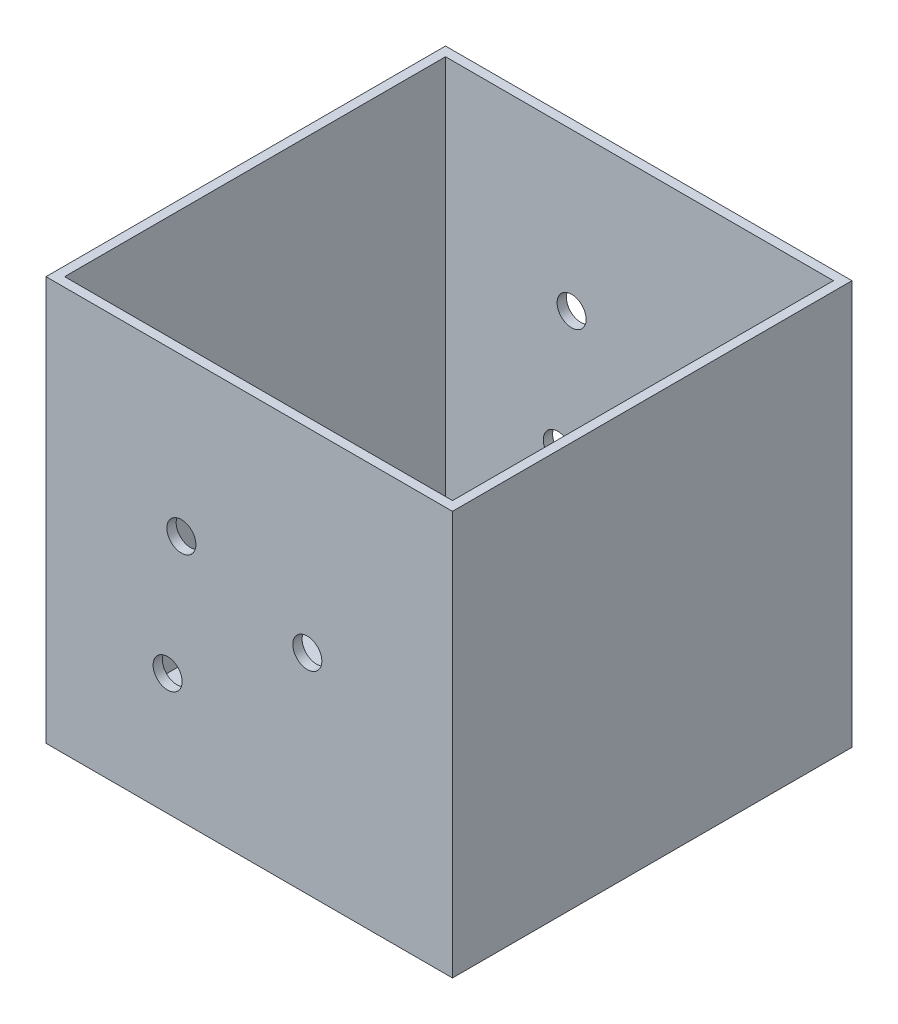
ISO-10303-21;
HEADER;
FILE_DESCRIPTION(('STEP AP214'),'2;1');
FILE_NAME('part.step','',(''),(''),'','','');
FILE_SCHEMA(('AUTOMOTIVE_DESIGN { 1 0 10303 214 1 1 1 1 }'));
ENDSEC;
DATA;
#1=APPLICATION_CONTEXT('core data for automotive mechanical design processes');
#2=APPLICATION_PROTOCOL_DEFINITION('international standard','automotive_design',2000,#1);
#3=PRODUCT_CONTEXT('',#1,'mechanical');
#4=PRODUCT('Part','Part','',(#3));
#5=PRODUCT_RELATED_PRODUCT_CATEGORY('part','',(#4));
#6=PRODUCT_DEFINITION_FORMATION('','',#4);
#7=PRODUCT_DEFINITION_CONTEXT('part definition',#1,'design');
#8=PRODUCT_DEFINITION('design','',#6,#7);
#9=PRODUCT_DEFINITION_SHAPE('','',#8);
#10=(LENGTH_UNIT() NAMED_UNIT(*) SI_UNIT(.MILLI.,.METRE.));
#11=(NAMED_UNIT(*) PLANE_ANGLE_UNIT() SI_UNIT($,.RADIAN.));
#12=(NAMED_UNIT(*) SI_UNIT($,.STERADIAN.) SOLID_ANGLE_UNIT());
#13=UNCERTAINTY_MEASURE_WITH_UNIT(LENGTH_MEASURE(1.E-05),#10,'distance_accuracy_value','');
#14=(GEOMETRIC_REPRESENTATION_CONTEXT(3) GLOBAL_UNCERTAINTY_ASSIGNED_CONTEXT((#13)) GLOBAL_UNIT_ASSIGNED_CONTEXT((#10,
#11,#12)) REPRESENTATION_CONTEXT('',''));
#15=CARTESIAN_POINT('',(0.,0.,0.));
#16=DIRECTION('',(0.,0.,1.));
#17=DIRECTION('',(1.,0.,0.));
#18=AXIS2_PLACEMENT_3D('',#15,#16,#17);
#19=CARTESIAN_POINT('',(0.,168.,-344.));
#20=DIRECTION('',(0.,-1.,0.));
#21=DIRECTION('',(0.,0.,-1.));
#22=AXIS2_PLACEMENT_3D('',#19,#20,#21);
#23=PLANE('',#22);
#24=DIRECTION('',(1.,0.,0.));
#25=VECTOR('',#24,1.);
#26=CARTESIAN_POINT('',(0.,168.,0.));
#27=LINE('',#26,#25);
#28=CARTESIAN_POINT('',(-225.,168.,0.));
#29=VERTEX_POINT('',#28);
#30=CARTESIAN_POINT('',(125.,168.,0.));
#31=VERTEX_POINT('',#30);
#32=EDGE_CURVE('E232',#29,#31,#27,.T.);
#33=ORIENTED_EDGE('',*,*,#32,.T.);
#34=DIRECTION('',(0.,0.,1.));
#35=VECTOR('',#34,1.);
#36=CARTESIAN_POINT('',(125.,168.,-344.));
#37=LINE('',#36,#35);
#38=CARTESIAN_POINT('',(125.,168.,-344.));
#39=VERTEX_POINT('',#38);
#40=EDGE_CURVE('E244',#39,#31,#37,.T.);
#41=ORIENTED_EDGE('',*,*,#40,.F.);
#42=DIRECTION('',(1.,0.,0.));
#43=VECTOR('',#42,1.);
#44=CARTESIAN_POINT('',(0.,168.,-344.));
#45=LINE('',#44,#43);
#46=CARTESIAN_POINT('',(-225.,168.,-344.));
#47=VERTEX_POINT('',#46);
#48=EDGE_CURVE('E207',#47,#39,#45,.T.);
#49=ORIENTED_EDGE('',*,*,#48,.F.);
#50=DIRECTION('',(0.,0.,1.));
#51=VECTOR('',#50,1.);
#52=CARTESIAN_POINT('',(-225.,168.,-344.));
#53=LINE('',#52,#51);
#54=EDGE_CURVE('E57',#47,#29,#53,.T.);
#55=ORIENTED_EDGE('',*,*,#54,.T.);
#56=EDGE_LOOP('',(#33,#41,#49,#55));
#57=FACE_BOUND('',#56,.T.);
#58=DIRECTION('',(1.,0.,0.));
#59=VECTOR('',#58,1.);
#60=CARTESIAN_POINT('',(0.,168.,-8.));
#61=LINE('',#60,#59);
#62=CARTESIAN_POINT('',(-217.,168.,-8.));
#63=VERTEX_POINT('',#62);
#64=CARTESIAN_POINT('',(117.,168.,-8.));
#65=VERTEX_POINT('',#64);
#66=EDGE_CURVE('E163',#63,#65,#61,.T.);
#67=ORIENTED_EDGE('',*,*,#66,.F.);
#68=DIRECTION('',(0.,0.,1.));
#69=VECTOR('',#68,1.);
#70=CARTESIAN_POINT('',(-217.,168.,-344.));
#71=LINE('',#70,#69);
#72=CARTESIAN_POINT('',(-217.,168.,-336.));
#73=VERTEX_POINT('',#72);
#74=EDGE_CURVE('E129',#73,#63,#71,.T.);
#75=ORIENTED_EDGE('',*,*,#74,.F.);
#76=DIRECTION('',(1.,0.,0.));
#77=VECTOR('',#76,1.);
#78=CARTESIAN_POINT('',(0.,168.,-336.));
#79=LINE('',#78,#77);
#80=CARTESIAN_POINT('',(117.,168.,-336.));
#81=VERTEX_POINT('',#80);
#82=EDGE_CURVE('E144',#73,#81,#79,.T.);
#83=ORIENTED_EDGE('',*,*,#82,.T.);
#84=DIRECTION('',(0.,0.,1.));
#85=VECTOR('',#84,1.);
#86=CARTESIAN_POINT('',(117.,168.,-344.));
#87=LINE('',#86,#85);
#88=EDGE_CURVE('E167',#81,#65,#87,.T.);
#89=ORIENTED_EDGE('',*,*,#88,.T.);
#90=EDGE_LOOP('',(#67,#75,#83,#89));
#91=FACE_BOUND('',#90,.T.);
#92=ADVANCED_FACE('F47',(#57,#91),#23,.F.);
#93=CARTESIAN_POINT('',(-120.297461902119,-75.4487949533203,-344.));
#94=DIRECTION('',(0.,0.,1.));
#95=DIRECTION('',(1.,0.,0.));
#96=AXIS2_PLACEMENT_3D('',#93,#94,#95);
#97=CYLINDRICAL_SURFACE('',#96,12.5);
#98=CARTESIAN_POINT('',(-120.297461902119,-75.4487949533203,0.));
#99=DIRECTION('',(0.,0.,1.));
#100=DIRECTION('',(1.,0.,0.));
#101=AXIS2_PLACEMENT_3D('',#98,#99,#100);
#102=CIRCLE('',#101,12.5);
#103=CARTESIAN_POINT('',(-107.797461902119,-75.4487949533203,0.));
#104=VERTEX_POINT('',#103);
#105=EDGE_CURVE('E220',#104,#104,#102,.T.);
#106=ORIENTED_EDGE('',*,*,#105,.T.);
#107=EDGE_LOOP('',(#106));
#108=FACE_BOUND('',#107,.T.);
#109=CARTESIAN_POINT('',(-120.297461902119,-75.4487949533203,-8.00000000000001));
#110=DIRECTION('',(0.,0.,1.));
#111=DIRECTION('',(1.,0.,0.));
#112=AXIS2_PLACEMENT_3D('',#109,#110,#111);
#113=CIRCLE('',#112,12.5);
#114=CARTESIAN_POINT('',(-107.797461902119,-75.4487949533203,-8.00000000000001));
#115=VERTEX_POINT('',#114);
#116=EDGE_CURVE('E186',#115,#115,#113,.T.);
#117=ORIENTED_EDGE('',*,*,#116,.F.);
#118=EDGE_LOOP('',(#117));
#119=FACE_BOUND('',#118,.T.);
#120=ADVANCED_FACE('F284',(#108,#119),#97,.F.);
#121=CARTESIAN_POINT('',(-108.440540320738,32.6528974969507,-344.));
#122=DIRECTION('',(0.,0.,1.));
#123=DIRECTION('',(1.,0.,0.));
#124=AXIS2_PLACEMENT_3D('',#121,#122,#123);
#125=CYLINDRICAL_SURFACE('',#124,12.5);
#126=CARTESIAN_POINT('',(-108.440540320738,32.6528974969507,0.));
#127=DIRECTION('',(0.,0.,1.));
#128=DIRECTION('',(1.,0.,0.));
#129=AXIS2_PLACEMENT_3D('',#126,#127,#128);
#130=CIRCLE('',#129,12.5);
#131=CARTESIAN_POINT('',(-95.9405403207381,32.6528974969507,0.));
#132=VERTEX_POINT('',#131);
#133=EDGE_CURVE('E128',#132,#132,#130,.T.);
#134=ORIENTED_EDGE('',*,*,#133,.T.);
#135=EDGE_LOOP('',(#134));
#136=FACE_BOUND('',#135,.T.);
#137=CARTESIAN_POINT('',(-108.440540320738,32.6528974969507,-8.00000000000001));
#138=DIRECTION('',(0.,0.,1.));
#139=DIRECTION('',(1.,0.,0.));
#140=AXIS2_PLACEMENT_3D('',#137,#138,#139);
#141=CIRCLE('',#140,12.5);
#142=CARTESIAN_POINT('',(-95.9405403207381,32.6528974969507,-8.00000000000001));
#143=VERTEX_POINT('',#142);
#144=EDGE_CURVE('E182',#143,#143,#141,.T.);
#145=ORIENTED_EDGE('',*,*,#144,.F.);
#146=EDGE_LOOP('',(#145));
#147=FACE_BOUND('',#146,.T.);
#148=ADVANCED_FACE('F278',(#136,#147),#125,.F.);
#149=CARTESIAN_POINT('',(0.,0.,-344.));
#150=DIRECTION('',(0.,0.,1.));
#151=DIRECTION('',(1.,0.,0.));
#152=AXIS2_PLACEMENT_3D('',#149,#150,#151);
#153=CYLINDRICAL_SURFACE('',#152,12.5);
#154=CARTESIAN_POINT('',(0.,0.,0.));
#155=DIRECTION('',(0.,0.,1.));
#156=DIRECTION('',(1.,0.,0.));
#157=AXIS2_PLACEMENT_3D('',#154,#155,#156);
#158=CIRCLE('',#157,12.5);
#159=CARTESIAN_POINT('',(12.5,0.,0.));
#160=VERTEX_POINT('',#159);
#161=EDGE_CURVE('E198',#160,#160,#158,.T.);
#162=ORIENTED_EDGE('',*,*,#161,.T.);
#163=EDGE_LOOP('',(#162));
#164=FACE_BOUND('',#163,.T.);
#165=CARTESIAN_POINT('',(0.,0.,-8.00000000000001));
#166=DIRECTION('',(0.,0.,1.));
#167=DIRECTION('',(1.,0.,0.));
#168=AXIS2_PLACEMENT_3D('',#165,#166,#167);
#169=CIRCLE('',#168,12.5);
#170=CARTESIAN_POINT('',(12.5,0.,-8.00000000000001));
#171=VERTEX_POINT('',#170);
#172=EDGE_CURVE('E178',#171,#171,#169,.T.);
#173=ORIENTED_EDGE('',*,*,#172,.F.);
#174=EDGE_LOOP('',(#173));
#175=FACE_BOUND('',#174,.T.);
#176=ADVANCED_FACE('F272',(#164,#175),#153,.F.);
#177=CARTESIAN_POINT('',(0.,-180.,-344.));
#178=DIRECTION('',(0.,-1.,0.));
#179=DIRECTION('',(0.,0.,-1.));
#180=AXIS2_PLACEMENT_3D('',#177,#178,#179);
#181=PLANE('',#180);
#182=DIRECTION('',(1.,0.,0.));
#183=VECTOR('',#182,1.);
#184=CARTESIAN_POINT('',(0.,-180.,0.));
#185=LINE('',#184,#183);
#186=CARTESIAN_POINT('',(-225.,-180.,0.));
#187=VERTEX_POINT('',#186);
#188=CARTESIAN_POINT('',(125.,-180.,0.));
#189=VERTEX_POINT('',#188);
#190=EDGE_CURVE('E224',#187,#189,#185,.T.);
#191=ORIENTED_EDGE('',*,*,#190,.F.);
#192=DIRECTION('',(0.,0.,1.));
#193=VECTOR('',#192,1.);
#194=CARTESIAN_POINT('',(-225.,-180.,-344.));
#195=LINE('',#194,#193);
#196=CARTESIAN_POINT('',(-225.,-180.,-344.));
#197=VERTEX_POINT('',#196);
#198=EDGE_CURVE('E11',#197,#187,#195,.T.);
#199=ORIENTED_EDGE('',*,*,#198,.F.);
#200=DIRECTION('',(1.,0.,0.));
#201=VECTOR('',#200,1.);
#202=CARTESIAN_POINT('',(0.,-180.,-344.));
#203=LINE('',#202,#201);
#204=CARTESIAN_POINT('',(125.,-180.,-344.));
#205=VERTEX_POINT('',#204);
#206=EDGE_CURVE('E202',#197,#205,#203,.T.);
#207=ORIENTED_EDGE('',*,*,#206,.T.);
#208=DIRECTION('',(0.,0.,1.));
#209=VECTOR('',#208,1.);
#210=CARTESIAN_POINT('',(125.,-180.,-344.));
#211=LINE('',#210,#209);
#212=EDGE_CURVE('E51',#205,#189,#211,.T.);
#213=ORIENTED_EDGE('',*,*,#212,.T.);
#214=EDGE_LOOP('',(#191,#199,#207,#213));
#215=FACE_BOUND('',#214,.T.);
#216=ADVANCED_FACE('F250',(#215),#181,.T.);
#217=CARTESIAN_POINT('',(-225.,0.,-344.));
#218=DIRECTION('',(-1.,0.,0.));
#219=DIRECTION('',(0.,0.,1.));
#220=AXIS2_PLACEMENT_3D('',#217,#218,#219);
#221=PLANE('',#220);
#222=DIRECTION('',(0.,-1.,0.));
#223=VECTOR('',#222,1.);
#224=CARTESIAN_POINT('',(-225.,0.,0.));
#225=LINE('',#224,#223);
#226=EDGE_CURVE('E236',#29,#187,#225,.T.);
#227=ORIENTED_EDGE('',*,*,#226,.F.);
#228=ORIENTED_EDGE('',*,*,#54,.F.);
#229=DIRECTION('',(0.,-1.,0.));
#230=VECTOR('',#229,1.);
#231=CARTESIAN_POINT('',(-225.,0.,-344.));
#232=LINE('',#231,#230);
#233=EDGE_CURVE('E210',#47,#197,#232,.T.);
#234=ORIENTED_EDGE('',*,*,#233,.T.);
#235=ORIENTED_EDGE('',*,*,#198,.T.);
#236=EDGE_LOOP('',(#227,#228,#234,#235));
#237=FACE_BOUND('',#236,.T.);
#238=ADVANCED_FACE('F256',(#237),#221,.T.);
#239=CARTESIAN_POINT('',(125.,0.,-344.));
#240=DIRECTION('',(-1.,0.,0.));
#241=DIRECTION('',(0.,0.,1.));
#242=AXIS2_PLACEMENT_3D('',#239,#240,#241);
#243=PLANE('',#242);
#244=DIRECTION('',(0.,-1.,0.));
#245=VECTOR('',#244,1.);
#246=CARTESIAN_POINT('',(125.,0.,0.));
#247=LINE('',#246,#245);
#248=EDGE_CURVE('E228',#31,#189,#247,.T.);
#249=ORIENTED_EDGE('',*,*,#248,.T.);
#250=ORIENTED_EDGE('',*,*,#212,.F.);
#251=DIRECTION('',(0.,-1.,0.));
#252=VECTOR('',#251,1.);
#253=CARTESIAN_POINT('',(125.,0.,-344.));
#254=LINE('',#253,#252);
#255=EDGE_CURVE('E98',#39,#205,#254,.T.);
#256=ORIENTED_EDGE('',*,*,#255,.F.);
#257=ORIENTED_EDGE('',*,*,#40,.T.);
#258=EDGE_LOOP('',(#249,#250,#256,#257));
#259=FACE_BOUND('',#258,.T.);
#260=ADVANCED_FACE('F251',(#259),#243,.F.);
#261=CARTESIAN_POINT('',(-120.297461902119,-75.4487949533203,-336.));
#262=DIRECTION('',(0.,0.,1.));
#263=DIRECTION('',(1.,0.,0.));
#264=AXIS2_PLACEMENT_3D('',#261,#262,#263);
#265=CIRCLE('',#264,12.5);
#266=CARTESIAN_POINT('',(-107.797461902119,-75.4487949533203,-336.));
#267=VERTEX_POINT('',#266);
#268=EDGE_CURVE('E139',#267,#267,#265,.T.);
#269=ORIENTED_EDGE('',*,*,#268,.T.);
#270=EDGE_LOOP('',(#269));
#271=FACE_BOUND('',#270,.T.);
#272=CARTESIAN_POINT('',(-120.297461902119,-75.4487949533203,-344.));
#273=DIRECTION('',(0.,0.,1.));
#274=DIRECTION('',(1.,0.,0.));
#275=AXIS2_PLACEMENT_3D('',#272,#273,#274);
#276=CIRCLE('',#275,12.5);
#277=CARTESIAN_POINT('',(-107.797461902119,-75.4487949533203,-344.));
#278=VERTEX_POINT('',#277);
#279=EDGE_CURVE('E197',#278,#278,#276,.T.);
#280=ORIENTED_EDGE('',*,*,#279,.F.);
#281=EDGE_LOOP('',(#280));
#282=FACE_BOUND('',#281,.T.);
#283=ADVANCED_FACE('F276',(#271,#282),#97,.F.);
#284=CARTESIAN_POINT('',(-108.440540320738,32.6528974969507,-336.));
#285=DIRECTION('',(0.,0.,1.));
#286=DIRECTION('',(1.,0.,0.));
#287=AXIS2_PLACEMENT_3D('',#284,#285,#286);
#288=CIRCLE('',#287,12.5);
#289=CARTESIAN_POINT('',(-95.9405403207381,32.6528974969507,-336.));
#290=VERTEX_POINT('',#289);
#291=EDGE_CURVE('E174',#290,#290,#288,.T.);
#292=ORIENTED_EDGE('',*,*,#291,.T.);
#293=EDGE_LOOP('',(#292));
#294=FACE_BOUND('',#293,.T.);
#295=CARTESIAN_POINT('',(-108.440540320738,32.6528974969507,-344.));
#296=DIRECTION('',(0.,0.,1.));
#297=DIRECTION('',(1.,0.,0.));
#298=AXIS2_PLACEMENT_3D('',#295,#296,#297);
#299=CIRCLE('',#298,12.5);
#300=CARTESIAN_POINT('',(-95.9405403207381,32.6528974969507,-344.));
#301=VERTEX_POINT('',#300);
#302=EDGE_CURVE('E193',#301,#301,#299,.T.);
#303=ORIENTED_EDGE('',*,*,#302,.F.);
#304=EDGE_LOOP('',(#303));
#305=FACE_BOUND('',#304,.T.);
#306=ADVANCED_FACE('F49',(#294,#305),#125,.F.);
#307=CARTESIAN_POINT('',(0.,0.,-336.));
#308=DIRECTION('',(0.,0.,1.));
#309=DIRECTION('',(1.,0.,0.));
#310=AXIS2_PLACEMENT_3D('',#307,#308,#309);
#311=CIRCLE('',#310,12.5);
#312=CARTESIAN_POINT('',(12.5,0.,-336.));
#313=VERTEX_POINT('',#312);
#314=EDGE_CURVE('E147',#313,#313,#311,.T.);
#315=ORIENTED_EDGE('',*,*,#314,.T.);
#316=EDGE_LOOP('',(#315));
#317=FACE_BOUND('',#316,.T.);
#318=CARTESIAN_POINT('',(0.,0.,-344.));
#319=DIRECTION('',(0.,0.,1.));
#320=DIRECTION('',(1.,0.,0.));
#321=AXIS2_PLACEMENT_3D('',#318,#319,#320);
#322=CIRCLE('',#321,12.5);
#323=CARTESIAN_POINT('',(12.5,0.,-344.));
#324=VERTEX_POINT('',#323);
#325=EDGE_CURVE('E213',#324,#324,#322,.T.);
#326=ORIENTED_EDGE('',*,*,#325,.F.);
#327=EDGE_LOOP('',(#326));
#328=FACE_BOUND('',#327,.T.);
#329=ADVANCED_FACE('F264',(#317,#328),#153,.F.);
#330=CARTESIAN_POINT('',(0.,0.,-344.));
#331=DIRECTION('',(0.,0.,1.));
#332=DIRECTION('',(1.,0.,0.));
#333=AXIS2_PLACEMENT_3D('',#330,#331,#332);
#334=PLANE('',#333);
#335=ORIENTED_EDGE('',*,*,#302,.T.);
#336=EDGE_LOOP('',(#335));
#337=FACE_BOUND('',#336,.T.);
#338=ORIENTED_EDGE('',*,*,#279,.T.);
#339=EDGE_LOOP('',(#338));
#340=FACE_BOUND('',#339,.T.);
#341=ORIENTED_EDGE('',*,*,#206,.F.);
#342=ORIENTED_EDGE('',*,*,#233,.F.);
#343=ORIENTED_EDGE('',*,*,#48,.T.);
#344=ORIENTED_EDGE('',*,*,#255,.T.);
#345=EDGE_LOOP('',(#341,#342,#343,#344));
#346=FACE_BOUND('',#345,.T.);
#347=ORIENTED_EDGE('',*,*,#325,.T.);
#348=EDGE_LOOP('',(#347));
#349=FACE_BOUND('',#348,.T.);
#350=ADVANCED_FACE('F261',(#337,#340,#346,#349),#334,.F.);
#351=CARTESIAN_POINT('',(0.,0.,0.));
#352=DIRECTION('',(0.,0.,1.));
#353=DIRECTION('',(1.,0.,0.));
#354=AXIS2_PLACEMENT_3D('',#351,#352,#353);
#355=PLANE('',#354);
#356=ORIENTED_EDGE('',*,*,#133,.F.);
#357=EDGE_LOOP('',(#356));
#358=FACE_BOUND('',#357,.T.);
#359=ORIENTED_EDGE('',*,*,#105,.F.);
#360=EDGE_LOOP('',(#359));
#361=FACE_BOUND('',#360,.T.);
#362=ORIENTED_EDGE('',*,*,#190,.T.);
#363=ORIENTED_EDGE('',*,*,#248,.F.);
#364=ORIENTED_EDGE('',*,*,#32,.F.);
#365=ORIENTED_EDGE('',*,*,#226,.T.);
#366=EDGE_LOOP('',(#362,#363,#364,#365));
#367=FACE_BOUND('',#366,.T.);
#368=ORIENTED_EDGE('',*,*,#161,.F.);
#369=EDGE_LOOP('',(#368));
#370=FACE_BOUND('',#369,.T.);
#371=ADVANCED_FACE('F254',(#358,#361,#367,#370),#355,.T.);
#372=CARTESIAN_POINT('',(0.,-172.,-344.));
#373=DIRECTION('',(0.,-1.,0.));
#374=DIRECTION('',(0.,0.,-1.));
#375=AXIS2_PLACEMENT_3D('',#372,#373,#374);
#376=PLANE('',#375);
#377=DIRECTION('',(1.,0.,0.));
#378=VECTOR('',#377,1.);
#379=CARTESIAN_POINT('',(0.,-172.,-8.));
#380=LINE('',#379,#378);
#381=CARTESIAN_POINT('',(-217.,-172.,-8.));
#382=VERTEX_POINT('',#381);
#383=CARTESIAN_POINT('',(117.,-172.,-8.));
#384=VERTEX_POINT('',#383);
#385=EDGE_CURVE('E164',#382,#384,#380,.T.);
#386=ORIENTED_EDGE('',*,*,#385,.T.);
#387=DIRECTION('',(0.,0.,1.));
#388=VECTOR('',#387,1.);
#389=CARTESIAN_POINT('',(117.,-172.,-344.));
#390=LINE('',#389,#388);
#391=CARTESIAN_POINT('',(117.,-172.,-336.));
#392=VERTEX_POINT('',#391);
#393=EDGE_CURVE('E135',#392,#384,#390,.T.);
#394=ORIENTED_EDGE('',*,*,#393,.F.);
#395=DIRECTION('',(1.,0.,0.));
#396=VECTOR('',#395,1.);
#397=CARTESIAN_POINT('',(0.,-172.,-336.));
#398=LINE('',#397,#396);
#399=CARTESIAN_POINT('',(-217.,-172.,-336.));
#400=VERTEX_POINT('',#399);
#401=EDGE_CURVE('E133',#400,#392,#398,.T.);
#402=ORIENTED_EDGE('',*,*,#401,.F.);
#403=DIRECTION('',(0.,0.,1.));
#404=VECTOR('',#403,1.);
#405=CARTESIAN_POINT('',(-217.,-172.,-344.));
#406=LINE('',#405,#404);
#407=EDGE_CURVE('E119',#400,#382,#406,.T.);
#408=ORIENTED_EDGE('',*,*,#407,.T.);
#409=EDGE_LOOP('',(#386,#394,#402,#408));
#410=FACE_BOUND('',#409,.T.);
#411=ADVANCED_FACE('F134',(#410),#376,.F.);
#412=CARTESIAN_POINT('',(-217.,0.,-344.));
#413=DIRECTION('',(-1.,0.,0.));
#414=DIRECTION('',(0.,0.,1.));
#415=AXIS2_PLACEMENT_3D('',#412,#413,#414);
#416=PLANE('',#415);
#417=DIRECTION('',(0.,-1.,0.));
#418=VECTOR('',#417,1.);
#419=CARTESIAN_POINT('',(-217.,0.,-8.));
#420=LINE('',#419,#418);
#421=EDGE_CURVE('E123',#63,#382,#420,.T.);
#422=ORIENTED_EDGE('',*,*,#421,.T.);
#423=ORIENTED_EDGE('',*,*,#407,.F.);
#424=DIRECTION('',(0.,-1.,0.));
#425=VECTOR('',#424,1.);
#426=CARTESIAN_POINT('',(-217.,0.,-336.));
#427=LINE('',#426,#425);
#428=EDGE_CURVE('E65',#73,#400,#427,.T.);
#429=ORIENTED_EDGE('',*,*,#428,.F.);
#430=ORIENTED_EDGE('',*,*,#74,.T.);
#431=EDGE_LOOP('',(#422,#423,#429,#430));
#432=FACE_BOUND('',#431,.T.);
#433=ADVANCED_FACE('F121',(#432),#416,.F.);
#434=CARTESIAN_POINT('',(117.,0.,-344.));
#435=DIRECTION('',(-1.,0.,0.));
#436=DIRECTION('',(0.,0.,1.));
#437=AXIS2_PLACEMENT_3D('',#434,#435,#436);
#438=PLANE('',#437);
#439=DIRECTION('',(0.,-1.,0.));
#440=VECTOR('',#439,1.);
#441=CARTESIAN_POINT('',(117.,0.,-8.));
#442=LINE('',#441,#440);
#443=EDGE_CURVE('E159',#65,#384,#442,.T.);
#444=ORIENTED_EDGE('',*,*,#443,.F.);
#445=ORIENTED_EDGE('',*,*,#88,.F.);
#446=DIRECTION('',(0.,-1.,0.));
#447=VECTOR('',#446,1.);
#448=CARTESIAN_POINT('',(117.,0.,-336.));
#449=LINE('',#448,#447);
#450=EDGE_CURVE('E138',#81,#392,#449,.T.);
#451=ORIENTED_EDGE('',*,*,#450,.T.);
#452=ORIENTED_EDGE('',*,*,#393,.T.);
#453=EDGE_LOOP('',(#444,#445,#451,#452));
#454=FACE_BOUND('',#453,.T.);
#455=ADVANCED_FACE('F305',(#454),#438,.T.);
#456=CARTESIAN_POINT('',(0.,0.,-336.));
#457=DIRECTION('',(0.,0.,1.));
#458=DIRECTION('',(1.,0.,0.));
#459=AXIS2_PLACEMENT_3D('',#456,#457,#458);
#460=PLANE('',#459);
#461=ORIENTED_EDGE('',*,*,#291,.F.);
#462=EDGE_LOOP('',(#461));
#463=FACE_BOUND('',#462,.T.);
#464=ORIENTED_EDGE('',*,*,#268,.F.);
#465=EDGE_LOOP('',(#464));
#466=FACE_BOUND('',#465,.T.);
#467=ORIENTED_EDGE('',*,*,#401,.T.);
#468=ORIENTED_EDGE('',*,*,#450,.F.);
#469=ORIENTED_EDGE('',*,*,#82,.F.);
#470=ORIENTED_EDGE('',*,*,#428,.T.);
#471=EDGE_LOOP('',(#467,#468,#469,#470));
#472=FACE_BOUND('',#471,.T.);
#473=ORIENTED_EDGE('',*,*,#314,.F.);
#474=EDGE_LOOP('',(#473));
#475=FACE_BOUND('',#474,.T.);
#476=ADVANCED_FACE('F141',(#463,#466,#472,#475),#460,.T.);
#477=CARTESIAN_POINT('',(0.,0.,-8.));
#478=DIRECTION('',(0.,0.,1.));
#479=DIRECTION('',(1.,0.,0.));
#480=AXIS2_PLACEMENT_3D('',#477,#478,#479);
#481=PLANE('',#480);
#482=ORIENTED_EDGE('',*,*,#144,.T.);
#483=EDGE_LOOP('',(#482));
#484=FACE_BOUND('',#483,.T.);
#485=ORIENTED_EDGE('',*,*,#116,.T.);
#486=EDGE_LOOP('',(#485));
#487=FACE_BOUND('',#486,.T.);
#488=ORIENTED_EDGE('',*,*,#385,.F.);
#489=ORIENTED_EDGE('',*,*,#421,.F.);
#490=ORIENTED_EDGE('',*,*,#66,.T.);
#491=ORIENTED_EDGE('',*,*,#443,.T.);
#492=EDGE_LOOP('',(#488,#489,#490,#491));
#493=FACE_BOUND('',#492,.T.);
#494=ORIENTED_EDGE('',*,*,#172,.T.);
#495=EDGE_LOOP('',(#494));
#496=FACE_BOUND('',#495,.T.);
#497=ADVANCED_FACE('F304',(#484,#487,#493,#496),#481,.F.);
#498=CLOSED_SHELL('',(#92,#120,#148,#176,#216,#238,#260,#283,#306,#329,#350,#371,#411,#433,#455,
#476,#497));
#499=MANIFOLD_SOLID_BREP('B2',#498);
#500=ADVANCED_BREP_SHAPE_REPRESENTATION('',(#18,#499),#14);
#501=SHAPE_DEFINITION_REPRESENTATION(#9,#500);
ENDSEC;
END-ISO-10303-21;
